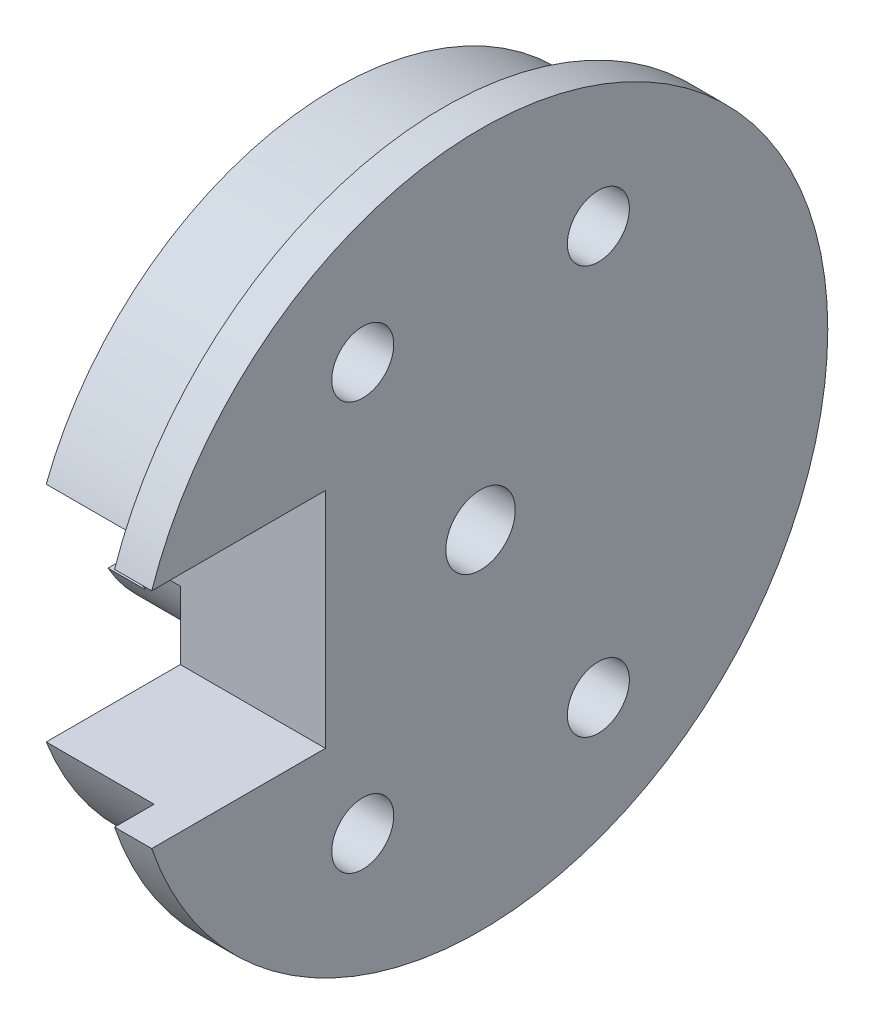
ISO-10303-21;
HEADER;
FILE_DESCRIPTION(('STEP AP214'),'2;1');
FILE_NAME('part.step','',(''),(''),'','','');
FILE_SCHEMA(('AUTOMOTIVE_DESIGN { 1 0 10303 214 1 1 1 1 }'));
ENDSEC;
DATA;
#1=APPLICATION_CONTEXT('core data for automotive mechanical design processes');
#2=APPLICATION_PROTOCOL_DEFINITION('international standard','automotive_design',2000,#1);
#3=PRODUCT_CONTEXT('',#1,'mechanical');
#4=PRODUCT('Part','Part','',(#3));
#5=PRODUCT_RELATED_PRODUCT_CATEGORY('part','',(#4));
#6=PRODUCT_DEFINITION_FORMATION('','',#4);
#7=PRODUCT_DEFINITION_CONTEXT('part definition',#1,'design');
#8=PRODUCT_DEFINITION('design','',#6,#7);
#9=PRODUCT_DEFINITION_SHAPE('','',#8);
#10=(LENGTH_UNIT() NAMED_UNIT(*) SI_UNIT(.MILLI.,.METRE.));
#11=(NAMED_UNIT(*) PLANE_ANGLE_UNIT() SI_UNIT($,.RADIAN.));
#12=(NAMED_UNIT(*) SI_UNIT($,.STERADIAN.) SOLID_ANGLE_UNIT());
#13=UNCERTAINTY_MEASURE_WITH_UNIT(LENGTH_MEASURE(1.E-05),#10,'distance_accuracy_value','');
#14=(GEOMETRIC_REPRESENTATION_CONTEXT(3) GLOBAL_UNCERTAINTY_ASSIGNED_CONTEXT((#13)) GLOBAL_UNIT_ASSIGNED_CONTEXT((#10,
#11,#12)) REPRESENTATION_CONTEXT('',''));
#15=CARTESIAN_POINT('',(0.,0.,0.));
#16=DIRECTION('',(0.,0.,1.));
#17=DIRECTION('',(1.,0.,0.));
#18=AXIS2_PLACEMENT_3D('',#15,#16,#17);
#19=CARTESIAN_POINT('',(-22.0709534368071,0.,0.));
#20=DIRECTION('',(-1.,0.,0.));
#21=DIRECTION('',(0.,0.,1.));
#22=AXIS2_PLACEMENT_3D('',#19,#20,#21);
#23=CYLINDRICAL_SURFACE('',#22,6.5);
#24=DIRECTION('',(-1.,0.,0.));
#25=VECTOR('',#24,1.);
#26=CARTESIAN_POINT('',(-22.0709534368071,1.76040625137492,6.25707358356285));
#27=LINE('',#26,#25);
#28=CARTESIAN_POINT('',(8.15,1.76040625137492,6.25707358356285));
#29=VERTEX_POINT('',#28);
#30=CARTESIAN_POINT('',(6.15,1.76040625137492,6.25707358356285));
#31=VERTEX_POINT('',#30);
#32=EDGE_CURVE('E58',#29,#31,#27,.T.);
#33=ORIENTED_EDGE('',*,*,#32,.F.);
#34=CARTESIAN_POINT('',(8.15,0.,0.));
#35=DIRECTION('',(-1.,0.,0.));
#36=DIRECTION('',(0.,0.,1.));
#37=AXIS2_PLACEMENT_3D('',#34,#35,#36);
#38=CIRCLE('',#37,6.5);
#39=CARTESIAN_POINT('',(8.15,-1.76040625137492,6.25707358356285));
#40=VERTEX_POINT('',#39);
#41=EDGE_CURVE('E241',#29,#40,#38,.T.);
#42=ORIENTED_EDGE('',*,*,#41,.T.);
#43=DIRECTION('',(-1.,0.,0.));
#44=VECTOR('',#43,1.);
#45=CARTESIAN_POINT('',(-22.0709534368071,-1.76040625137492,6.25707358356285));
#46=LINE('',#45,#44);
#47=CARTESIAN_POINT('',(6.15,-1.76040625137492,6.25707358356285));
#48=VERTEX_POINT('',#47);
#49=EDGE_CURVE('E177',#48,#40,#46,.F.);
#50=ORIENTED_EDGE('',*,*,#49,.F.);
#51=CARTESIAN_POINT('',(6.15,0.,0.));
#52=DIRECTION('',(1.,0.,0.));
#53=DIRECTION('',(0.,0.,-1.));
#54=AXIS2_PLACEMENT_3D('',#51,#52,#53);
#55=CIRCLE('',#54,6.5);
#56=CARTESIAN_POINT('',(6.15,-3.175,5.67180526816639));
#57=VERTEX_POINT('',#56);
#58=EDGE_CURVE('E66',#48,#57,#55,.T.);
#59=ORIENTED_EDGE('',*,*,#58,.T.);
#60=DIRECTION('',(-1.,0.,0.));
#61=VECTOR('',#60,1.);
#62=CARTESIAN_POINT('',(-22.0709534368071,-3.175,5.67180526816639));
#63=LINE('',#62,#61);
#64=CARTESIAN_POINT('',(4.65,-3.175,5.67180526816639));
#65=VERTEX_POINT('',#64);
#66=EDGE_CURVE('E200',#65,#57,#63,.F.);
#67=ORIENTED_EDGE('',*,*,#66,.F.);
#68=CARTESIAN_POINT('',(4.65,0.,0.));
#69=DIRECTION('',(-1.,0.,0.));
#70=DIRECTION('',(0.,0.,1.));
#71=AXIS2_PLACEMENT_3D('',#68,#69,#70);
#72=CIRCLE('',#71,6.5);
#73=CARTESIAN_POINT('',(4.65,-3.175,-5.67180526816639));
#74=VERTEX_POINT('',#73);
#75=EDGE_CURVE('E249',#74,#65,#72,.T.);
#76=ORIENTED_EDGE('',*,*,#75,.F.);
#77=DIRECTION('',(-1.,0.,0.));
#78=VECTOR('',#77,1.);
#79=CARTESIAN_POINT('',(-22.0709534368071,-3.175,-5.67180526816639));
#80=LINE('',#79,#78);
#81=CARTESIAN_POINT('',(6.15,-3.175,-5.67180526816639));
#82=VERTEX_POINT('',#81);
#83=EDGE_CURVE('E194',#82,#74,#80,.T.);
#84=ORIENTED_EDGE('',*,*,#83,.F.);
#85=CARTESIAN_POINT('',(6.15,3.175,-5.67180526816639));
#86=VERTEX_POINT('',#85);
#87=EDGE_CURVE('E185',#82,#86,#55,.T.);
#88=ORIENTED_EDGE('',*,*,#87,.T.);
#89=DIRECTION('',(-1.,0.,0.));
#90=VECTOR('',#89,1.);
#91=CARTESIAN_POINT('',(-22.0709534368071,3.175,-5.67180526816639));
#92=LINE('',#91,#90);
#93=CARTESIAN_POINT('',(4.65,3.175,-5.67180526816639));
#94=VERTEX_POINT('',#93);
#95=EDGE_CURVE('E197',#94,#86,#92,.F.);
#96=ORIENTED_EDGE('',*,*,#95,.F.);
#97=CARTESIAN_POINT('',(4.65,3.175,5.67180526816639));
#98=VERTEX_POINT('',#97);
#99=EDGE_CURVE('E250',#98,#94,#72,.T.);
#100=ORIENTED_EDGE('',*,*,#99,.F.);
#101=DIRECTION('',(-1.,0.,0.));
#102=VECTOR('',#101,1.);
#103=CARTESIAN_POINT('',(-22.0709534368071,3.175,5.67180526816639));
#104=LINE('',#103,#102);
#105=CARTESIAN_POINT('',(6.15,3.175,5.67180526816639));
#106=VERTEX_POINT('',#105);
#107=EDGE_CURVE('E203',#106,#98,#104,.T.);
#108=ORIENTED_EDGE('',*,*,#107,.F.);
#109=EDGE_CURVE('E195',#106,#31,#55,.T.);
#110=ORIENTED_EDGE('',*,*,#109,.T.);
#111=EDGE_LOOP('',(#33,#42,#50,#59,#67,#76,#84,#88,#96,#100,#108,#110));
#112=FACE_BOUND('',#111,.T.);
#113=ADVANCED_FACE('F43',(#112),#23,.T.);
#114=CARTESIAN_POINT('',(12.5,12.5,0.));
#115=DIRECTION('',(1.,0.,0.));
#116=DIRECTION('',(0.,0.,-1.));
#117=AXIS2_PLACEMENT_3D('',#114,#115,#116);
#118=PLANE('',#117);
#119=DIRECTION('',(0.,0.,-1.));
#120=VECTOR('',#119,1.);
#121=CARTESIAN_POINT('',(12.5,4.5,0.));
#122=LINE('',#121,#120);
#123=CARTESIAN_POINT('',(12.5,4.5,13.2570735835629));
#124=VERTEX_POINT('',#123);
#125=CARTESIAN_POINT('',(12.5,4.5,11.6619037896906));
#126=VERTEX_POINT('',#125);
#127=EDGE_CURVE('E349',#124,#126,#122,.T.);
#128=ORIENTED_EDGE('',*,*,#127,.F.);
#129=CARTESIAN_POINT('',(12.5,0.,0.));
#130=DIRECTION('',(-1.,0.,0.));
#131=DIRECTION('',(0.,0.,1.));
#132=AXIS2_PLACEMENT_3D('',#129,#130,#131);
#133=CIRCLE('',#132,14.);
#134=CARTESIAN_POINT('',(12.5,-4.5,13.2570735835629));
#135=VERTEX_POINT('',#134);
#136=EDGE_CURVE('E176',#124,#135,#133,.T.);
#137=ORIENTED_EDGE('',*,*,#136,.T.);
#138=DIRECTION('',(0.,0.,1.));
#139=VECTOR('',#138,1.);
#140=CARTESIAN_POINT('',(12.5,-4.5,0.));
#141=LINE('',#140,#139);
#142=CARTESIAN_POINT('',(12.5,-4.5,11.6619037896906));
#143=VERTEX_POINT('',#142);
#144=EDGE_CURVE('E223',#143,#135,#141,.T.);
#145=ORIENTED_EDGE('',*,*,#144,.F.);
#146=CARTESIAN_POINT('',(12.5,0.,0.));
#147=DIRECTION('',(-1.,0.,0.));
#148=DIRECTION('',(0.,0.,1.));
#149=AXIS2_PLACEMENT_3D('',#146,#147,#148);
#150=CIRCLE('',#149,12.5);
#151=EDGE_CURVE('E233',#126,#143,#150,.T.);
#152=ORIENTED_EDGE('',*,*,#151,.F.);
#153=EDGE_LOOP('',(#128,#137,#145,#152));
#154=FACE_BOUND('',#153,.T.);
#155=ADVANCED_FACE('F45',(#154),#118,.F.);
#156=CARTESIAN_POINT('',(-22.0709534368071,0.,0.));
#157=DIRECTION('',(-1.,0.,0.));
#158=DIRECTION('',(0.,0.,1.));
#159=AXIS2_PLACEMENT_3D('',#156,#157,#158);
#160=CYLINDRICAL_SURFACE('',#159,14.);
#161=DIRECTION('',(1.,0.,0.));
#162=VECTOR('',#161,1.);
#163=CARTESIAN_POINT('',(-14.,4.5,13.2570735835629));
#164=LINE('',#163,#162);
#165=CARTESIAN_POINT('',(14.,4.5,13.2570735835629));
#166=VERTEX_POINT('',#165);
#167=EDGE_CURVE('E159',#124,#166,#164,.T.);
#168=ORIENTED_EDGE('',*,*,#167,.T.);
#169=CARTESIAN_POINT('',(14.,0.,0.));
#170=DIRECTION('',(-1.,0.,0.));
#171=DIRECTION('',(0.,0.,1.));
#172=AXIS2_PLACEMENT_3D('',#169,#170,#171);
#173=CIRCLE('',#172,14.);
#174=CARTESIAN_POINT('',(14.,-4.5,13.2570735835629));
#175=VERTEX_POINT('',#174);
#176=EDGE_CURVE('E174',#166,#175,#173,.T.);
#177=ORIENTED_EDGE('',*,*,#176,.T.);
#178=DIRECTION('',(1.,0.,0.));
#179=VECTOR('',#178,1.);
#180=CARTESIAN_POINT('',(-14.,-4.5,13.2570735835629));
#181=LINE('',#180,#179);
#182=EDGE_CURVE('E361',#135,#175,#181,.T.);
#183=ORIENTED_EDGE('',*,*,#182,.F.);
#184=ORIENTED_EDGE('',*,*,#136,.F.);
#185=EDGE_LOOP('',(#168,#177,#183,#184));
#186=FACE_BOUND('',#185,.T.);
#187=ADVANCED_FACE('F172',(#186),#160,.T.);
#188=CARTESIAN_POINT('',(14.,14.,0.));
#189=DIRECTION('',(-1.,0.,0.));
#190=DIRECTION('',(0.,0.,1.));
#191=AXIS2_PLACEMENT_3D('',#188,#189,#190);
#192=PLANE('',#191);
#193=CARTESIAN_POINT('',(14.,0.,0.));
#194=DIRECTION('',(-1.,0.,0.));
#195=DIRECTION('',(0.,0.,1.));
#196=AXIS2_PLACEMENT_3D('',#193,#194,#195);
#197=CIRCLE('',#196,1.4);
#198=CARTESIAN_POINT('',(14.,0.,1.4));
#199=VERTEX_POINT('',#198);
#200=EDGE_CURVE('E183',#199,#199,#197,.T.);
#201=ORIENTED_EDGE('',*,*,#200,.T.);
#202=EDGE_LOOP('',(#201));
#203=FACE_BOUND('',#202,.T.);
#204=CARTESIAN_POINT('',(14.,8.22724133595217,4.75));
#205=DIRECTION('',(-1.,0.,0.));
#206=DIRECTION('',(0.,0.,1.));
#207=AXIS2_PLACEMENT_3D('',#204,#205,#206);
#208=CIRCLE('',#207,1.24999999999999);
#209=CARTESIAN_POINT('',(14.,8.22724133595217,5.99999999999999));
#210=VERTEX_POINT('',#209);
#211=EDGE_CURVE('E209',#210,#210,#208,.T.);
#212=ORIENTED_EDGE('',*,*,#211,.T.);
#213=EDGE_LOOP('',(#212));
#214=FACE_BOUND('',#213,.T.);
#215=CARTESIAN_POINT('',(14.,8.22724133595217,-4.75));
#216=DIRECTION('',(-1.,0.,0.));
#217=DIRECTION('',(0.,0.,1.));
#218=AXIS2_PLACEMENT_3D('',#215,#216,#217);
#219=CIRCLE('',#218,1.24999999999999);
#220=CARTESIAN_POINT('',(14.,8.22724133595217,-3.50000000000001));
#221=VERTEX_POINT('',#220);
#222=EDGE_CURVE('E210',#221,#221,#219,.T.);
#223=ORIENTED_EDGE('',*,*,#222,.T.);
#224=EDGE_LOOP('',(#223));
#225=FACE_BOUND('',#224,.T.);
#226=CARTESIAN_POINT('',(14.,-8.22724133595217,-4.75));
#227=DIRECTION('',(-1.,0.,0.));
#228=DIRECTION('',(0.,0.,1.));
#229=AXIS2_PLACEMENT_3D('',#226,#227,#228);
#230=CIRCLE('',#229,1.24999999999999);
#231=CARTESIAN_POINT('',(14.,-8.22724133595217,-3.5));
#232=VERTEX_POINT('',#231);
#233=EDGE_CURVE('E214',#232,#232,#230,.T.);
#234=ORIENTED_EDGE('',*,*,#233,.T.);
#235=EDGE_LOOP('',(#234));
#236=FACE_BOUND('',#235,.T.);
#237=CARTESIAN_POINT('',(14.,-8.22724133595217,4.75));
#238=DIRECTION('',(-1.,0.,0.));
#239=DIRECTION('',(0.,0.,1.));
#240=AXIS2_PLACEMENT_3D('',#237,#238,#239);
#241=CIRCLE('',#240,1.24999999999999);
#242=CARTESIAN_POINT('',(14.,-8.22724133595217,5.99999999999999));
#243=VERTEX_POINT('',#242);
#244=EDGE_CURVE('E218',#243,#243,#241,.T.);
#245=ORIENTED_EDGE('',*,*,#244,.T.);
#246=EDGE_LOOP('',(#245));
#247=FACE_BOUND('',#246,.T.);
#248=DIRECTION('',(0.,0.,-1.));
#249=VECTOR('',#248,1.);
#250=CARTESIAN_POINT('',(14.,4.5,6.25707358356285));
#251=LINE('',#250,#249);
#252=CARTESIAN_POINT('',(14.,4.5,6.25707358356285));
#253=VERTEX_POINT('',#252);
#254=EDGE_CURVE('E156',#166,#253,#251,.T.);
#255=ORIENTED_EDGE('',*,*,#254,.T.);
#256=DIRECTION('',(0.,-1.,0.));
#257=VECTOR('',#256,1.);
#258=CARTESIAN_POINT('',(14.,-4.5,6.25707358356285));
#259=LINE('',#258,#257);
#260=CARTESIAN_POINT('',(14.,-4.5,6.25707358356285));
#261=VERTEX_POINT('',#260);
#262=EDGE_CURVE('E167',#253,#261,#259,.T.);
#263=ORIENTED_EDGE('',*,*,#262,.T.);
#264=DIRECTION('',(0.,0.,1.));
#265=VECTOR('',#264,1.);
#266=CARTESIAN_POINT('',(14.,-4.5,6.25707358356285));
#267=LINE('',#266,#265);
#268=EDGE_CURVE('E182',#261,#175,#267,.T.);
#269=ORIENTED_EDGE('',*,*,#268,.T.);
#270=ORIENTED_EDGE('',*,*,#176,.F.);
#271=EDGE_LOOP('',(#255,#263,#269,#270));
#272=FACE_BOUND('',#271,.T.);
#273=ADVANCED_FACE('F180',(#203,#214,#225,#236,#247,#272),#192,.F.);
#274=CARTESIAN_POINT('',(8.15,6.5,0.));
#275=DIRECTION('',(1.,0.,0.));
#276=DIRECTION('',(0.,0.,-1.));
#277=AXIS2_PLACEMENT_3D('',#274,#275,#276);
#278=PLANE('',#277);
#279=CARTESIAN_POINT('',(8.15,8.22724133595217,4.75));
#280=DIRECTION('',(1.,0.,0.));
#281=DIRECTION('',(0.,0.,-1.));
#282=AXIS2_PLACEMENT_3D('',#279,#280,#281);
#283=CIRCLE('',#282,1.24999999999999);
#284=CARTESIAN_POINT('',(8.15,8.22724133595217,3.50000000000001));
#285=VERTEX_POINT('',#284);
#286=EDGE_CURVE('E335',#285,#285,#283,.T.);
#287=ORIENTED_EDGE('',*,*,#286,.T.);
#288=EDGE_LOOP('',(#287));
#289=FACE_BOUND('',#288,.T.);
#290=CARTESIAN_POINT('',(8.15,8.22724133595217,-4.75));
#291=DIRECTION('',(1.,0.,0.));
#292=DIRECTION('',(0.,0.,-1.));
#293=AXIS2_PLACEMENT_3D('',#290,#291,#292);
#294=CIRCLE('',#293,1.24999999999999);
#295=CARTESIAN_POINT('',(8.15,8.22724133595217,-6.));
#296=VERTEX_POINT('',#295);
#297=EDGE_CURVE('E206',#296,#296,#294,.T.);
#298=ORIENTED_EDGE('',*,*,#297,.T.);
#299=EDGE_LOOP('',(#298));
#300=FACE_BOUND('',#299,.T.);
#301=CARTESIAN_POINT('',(8.15,-8.22724133595217,-4.75));
#302=DIRECTION('',(1.,0.,0.));
#303=DIRECTION('',(0.,0.,-1.));
#304=AXIS2_PLACEMENT_3D('',#301,#302,#303);
#305=CIRCLE('',#304,1.25);
#306=CARTESIAN_POINT('',(8.15,-8.22724133595217,-5.99999999999999));
#307=VERTEX_POINT('',#306);
#308=EDGE_CURVE('E211',#307,#307,#305,.T.);
#309=ORIENTED_EDGE('',*,*,#308,.T.);
#310=EDGE_LOOP('',(#309));
#311=FACE_BOUND('',#310,.T.);
#312=CARTESIAN_POINT('',(8.15,-8.22724133595217,4.75));
#313=DIRECTION('',(1.,0.,0.));
#314=DIRECTION('',(0.,0.,-1.));
#315=AXIS2_PLACEMENT_3D('',#312,#313,#314);
#316=CIRCLE('',#315,1.25);
#317=CARTESIAN_POINT('',(8.15,-8.22724133595217,3.50000000000001));
#318=VERTEX_POINT('',#317);
#319=EDGE_CURVE('E215',#318,#318,#316,.T.);
#320=ORIENTED_EDGE('',*,*,#319,.T.);
#321=EDGE_LOOP('',(#320));
#322=FACE_BOUND('',#321,.T.);
#323=DIRECTION('',(0.,0.,-1.));
#324=VECTOR('',#323,1.);
#325=CARTESIAN_POINT('',(8.15,4.5,0.));
#326=LINE('',#325,#324);
#327=CARTESIAN_POINT('',(8.15,4.5,11.6619037896906));
#328=VERTEX_POINT('',#327);
#329=CARTESIAN_POINT('',(8.15,4.5,6.25707358356285));
#330=VERTEX_POINT('',#329);
#331=EDGE_CURVE('E234',#328,#330,#326,.T.);
#332=ORIENTED_EDGE('',*,*,#331,.F.);
#333=CARTESIAN_POINT('',(8.15,0.,0.));
#334=DIRECTION('',(-1.,0.,0.));
#335=DIRECTION('',(0.,0.,1.));
#336=AXIS2_PLACEMENT_3D('',#333,#334,#335);
#337=CIRCLE('',#336,12.5);
#338=CARTESIAN_POINT('',(8.15,-4.5,11.6619037896906));
#339=VERTEX_POINT('',#338);
#340=EDGE_CURVE('E238',#328,#339,#337,.T.);
#341=ORIENTED_EDGE('',*,*,#340,.T.);
#342=DIRECTION('',(0.,0.,1.));
#343=VECTOR('',#342,1.);
#344=CARTESIAN_POINT('',(8.15,-4.5,0.));
#345=LINE('',#344,#343);
#346=CARTESIAN_POINT('',(8.15,-4.5,6.25707358356285));
#347=VERTEX_POINT('',#346);
#348=EDGE_CURVE('E226',#347,#339,#345,.T.);
#349=ORIENTED_EDGE('',*,*,#348,.F.);
#350=DIRECTION('',(0.,-1.,0.));
#351=VECTOR('',#350,1.);
#352=CARTESIAN_POINT('',(8.15,6.5,6.25707358356285));
#353=LINE('',#352,#351);
#354=EDGE_CURVE('E354',#40,#347,#353,.T.);
#355=ORIENTED_EDGE('',*,*,#354,.F.);
#356=ORIENTED_EDGE('',*,*,#41,.F.);
#357=EDGE_CURVE('E353',#330,#29,#353,.T.);
#358=ORIENTED_EDGE('',*,*,#357,.F.);
#359=EDGE_LOOP('',(#332,#341,#349,#355,#356,#358));
#360=FACE_BOUND('',#359,.T.);
#361=ADVANCED_FACE('F369',(#289,#300,#311,#322,#360),#278,.F.);
#362=CARTESIAN_POINT('',(-22.0709534368071,0.,0.));
#363=DIRECTION('',(-1.,0.,0.));
#364=DIRECTION('',(0.,0.,1.));
#365=AXIS2_PLACEMENT_3D('',#362,#363,#364);
#366=CYLINDRICAL_SURFACE('',#365,12.5);
#367=DIRECTION('',(-1.,0.,0.));
#368=VECTOR('',#367,1.);
#369=CARTESIAN_POINT('',(-22.0709534368071,4.5,11.6619037896906));
#370=LINE('',#369,#368);
#371=EDGE_CURVE('E12',#126,#328,#370,.T.);
#372=ORIENTED_EDGE('',*,*,#371,.F.);
#373=ORIENTED_EDGE('',*,*,#151,.T.);
#374=DIRECTION('',(-1.,0.,0.));
#375=VECTOR('',#374,1.);
#376=CARTESIAN_POINT('',(-22.0709534368071,-4.5,11.6619037896906));
#377=LINE('',#376,#375);
#378=EDGE_CURVE('E51',#339,#143,#377,.F.);
#379=ORIENTED_EDGE('',*,*,#378,.F.);
#380=ORIENTED_EDGE('',*,*,#340,.F.);
#381=EDGE_LOOP('',(#372,#373,#379,#380));
#382=FACE_BOUND('',#381,.T.);
#383=ADVANCED_FACE('F237',(#382),#366,.T.);
#384=CARTESIAN_POINT('',(6.15,4.,0.));
#385=DIRECTION('',(1.,0.,0.));
#386=DIRECTION('',(0.,0.,-1.));
#387=AXIS2_PLACEMENT_3D('',#384,#385,#386);
#388=PLANE('',#387);
#389=DIRECTION('',(0.,-1.,0.));
#390=VECTOR('',#389,1.);
#391=CARTESIAN_POINT('',(6.15,4.,6.25707358356285));
#392=LINE('',#391,#390);
#393=EDGE_CURVE('E205',#31,#48,#392,.T.);
#394=ORIENTED_EDGE('',*,*,#393,.F.);
#395=ORIENTED_EDGE('',*,*,#109,.F.);
#396=DIRECTION('',(0.,0.,1.));
#397=VECTOR('',#396,1.);
#398=CARTESIAN_POINT('',(6.15,3.175,13.6352255206872));
#399=LINE('',#398,#397);
#400=CARTESIAN_POINT('',(6.15,3.175,2.43297657202037));
#401=VERTEX_POINT('',#400);
#402=EDGE_CURVE('E300',#401,#106,#399,.T.);
#403=ORIENTED_EDGE('',*,*,#402,.F.);
#404=CARTESIAN_POINT('',(6.15,0.,0.));
#405=DIRECTION('',(1.,0.,0.));
#406=DIRECTION('',(0.,0.,-1.));
#407=AXIS2_PLACEMENT_3D('',#404,#405,#406);
#408=CIRCLE('',#407,4.);
#409=CARTESIAN_POINT('',(6.15,-3.175,2.43297657202037));
#410=VERTEX_POINT('',#409);
#411=EDGE_CURVE('E282',#410,#401,#408,.F.);
#412=ORIENTED_EDGE('',*,*,#411,.F.);
#413=DIRECTION('',(0.,0.,-1.));
#414=VECTOR('',#413,1.);
#415=CARTESIAN_POINT('',(6.15,-3.175,13.6352255206872));
#416=LINE('',#415,#414);
#417=EDGE_CURVE('E333',#57,#410,#416,.T.);
#418=ORIENTED_EDGE('',*,*,#417,.F.);
#419=ORIENTED_EDGE('',*,*,#58,.F.);
#420=EDGE_LOOP('',(#394,#395,#403,#412,#418,#419));
#421=FACE_BOUND('',#420,.T.);
#422=ADVANCED_FACE('F275',(#421),#388,.F.);
#423=CARTESIAN_POINT('',(-22.0709534368071,0.,0.));
#424=DIRECTION('',(-1.,0.,0.));
#425=DIRECTION('',(0.,0.,1.));
#426=AXIS2_PLACEMENT_3D('',#423,#424,#425);
#427=CYLINDRICAL_SURFACE('',#426,4.);
#428=CARTESIAN_POINT('',(7.5,0.,0.));
#429=DIRECTION('',(-1.,0.,0.));
#430=DIRECTION('',(0.,0.,1.));
#431=AXIS2_PLACEMENT_3D('',#428,#429,#430);
#432=CIRCLE('',#431,4.);
#433=CARTESIAN_POINT('',(7.5,0.,4.));
#434=VERTEX_POINT('',#433);
#435=EDGE_CURVE('E257',#434,#434,#432,.T.);
#436=ORIENTED_EDGE('',*,*,#435,.F.);
#437=EDGE_LOOP('',(#436));
#438=FACE_BOUND('',#437,.T.);
#439=DIRECTION('',(-1.,0.,0.));
#440=VECTOR('',#439,1.);
#441=CARTESIAN_POINT('',(-22.0709534368071,3.175,2.43297657202037));
#442=LINE('',#441,#440);
#443=CARTESIAN_POINT('',(4.65,3.175,2.43297657202037));
#444=VERTEX_POINT('',#443);
#445=EDGE_CURVE('E239',#444,#401,#442,.F.);
#446=ORIENTED_EDGE('',*,*,#445,.F.);
#447=CARTESIAN_POINT('',(4.65,0.,0.));
#448=DIRECTION('',(-1.,0.,0.));
#449=DIRECTION('',(0.,0.,1.));
#450=AXIS2_PLACEMENT_3D('',#447,#448,#449);
#451=CIRCLE('',#450,4.);
#452=CARTESIAN_POINT('',(4.65,3.175,-2.43297657202037));
#453=VERTEX_POINT('',#452);
#454=EDGE_CURVE('E254',#444,#453,#451,.T.);
#455=ORIENTED_EDGE('',*,*,#454,.T.);
#456=DIRECTION('',(-1.,0.,0.));
#457=VECTOR('',#456,1.);
#458=CARTESIAN_POINT('',(-22.0709534368071,3.175,-2.43297657202037));
#459=LINE('',#458,#457);
#460=CARTESIAN_POINT('',(6.15,3.175,-2.43297657202037));
#461=VERTEX_POINT('',#460);
#462=EDGE_CURVE('E293',#461,#453,#459,.T.);
#463=ORIENTED_EDGE('',*,*,#462,.F.);
#464=CARTESIAN_POINT('',(6.15,-3.175,-2.43297657202037));
#465=VERTEX_POINT('',#464);
#466=EDGE_CURVE('E307',#461,#465,#408,.F.);
#467=ORIENTED_EDGE('',*,*,#466,.T.);
#468=DIRECTION('',(-1.,0.,0.));
#469=VECTOR('',#468,1.);
#470=CARTESIAN_POINT('',(-22.0709534368071,-3.175,-2.43297657202037));
#471=LINE('',#470,#469);
#472=CARTESIAN_POINT('',(4.65,-3.175,-2.43297657202037));
#473=VERTEX_POINT('',#472);
#474=EDGE_CURVE('E294',#473,#465,#471,.F.);
#475=ORIENTED_EDGE('',*,*,#474,.F.);
#476=CARTESIAN_POINT('',(4.65,-3.175,2.43297657202037));
#477=VERTEX_POINT('',#476);
#478=EDGE_CURVE('E253',#473,#477,#451,.T.);
#479=ORIENTED_EDGE('',*,*,#478,.T.);
#480=DIRECTION('',(-1.,0.,0.));
#481=VECTOR('',#480,1.);
#482=CARTESIAN_POINT('',(-22.0709534368071,-3.175,2.43297657202037));
#483=LINE('',#482,#481);
#484=EDGE_CURVE('E320',#410,#477,#483,.T.);
#485=ORIENTED_EDGE('',*,*,#484,.F.);
#486=ORIENTED_EDGE('',*,*,#411,.T.);
#487=EDGE_LOOP('',(#446,#455,#463,#467,#475,#479,#485,#486));
#488=FACE_BOUND('',#487,.T.);
#489=ADVANCED_FACE('F271',(#438,#488),#427,.F.);
#490=CARTESIAN_POINT('',(4.65,4.,0.));
#491=DIRECTION('',(1.,0.,0.));
#492=DIRECTION('',(0.,0.,-1.));
#493=AXIS2_PLACEMENT_3D('',#490,#491,#492);
#494=PLANE('',#493);
#495=DIRECTION('',(0.,0.,-1.));
#496=VECTOR('',#495,1.);
#497=CARTESIAN_POINT('',(4.65,3.175,0.));
#498=LINE('',#497,#496);
#499=EDGE_CURVE('E243',#98,#444,#498,.T.);
#500=ORIENTED_EDGE('',*,*,#499,.F.);
#501=ORIENTED_EDGE('',*,*,#99,.T.);
#502=EDGE_CURVE('E290',#453,#94,#498,.T.);
#503=ORIENTED_EDGE('',*,*,#502,.F.);
#504=ORIENTED_EDGE('',*,*,#454,.F.);
#505=EDGE_LOOP('',(#500,#501,#503,#504));
#506=FACE_BOUND('',#505,.T.);
#507=ADVANCED_FACE('F274',(#506),#494,.F.);
#508=DIRECTION('',(0.,0.,1.));
#509=VECTOR('',#508,1.);
#510=CARTESIAN_POINT('',(4.65,-3.175,0.));
#511=LINE('',#510,#509);
#512=EDGE_CURVE('E296',#74,#473,#511,.T.);
#513=ORIENTED_EDGE('',*,*,#512,.F.);
#514=ORIENTED_EDGE('',*,*,#75,.T.);
#515=EDGE_CURVE('E315',#477,#65,#511,.T.);
#516=ORIENTED_EDGE('',*,*,#515,.F.);
#517=ORIENTED_EDGE('',*,*,#478,.F.);
#518=EDGE_LOOP('',(#513,#514,#516,#517));
#519=FACE_BOUND('',#518,.T.);
#520=ADVANCED_FACE('F331',(#519),#494,.F.);
#521=CARTESIAN_POINT('',(-22.0709534368071,0.,0.));
#522=DIRECTION('',(-1.,0.,0.));
#523=DIRECTION('',(0.,0.,1.));
#524=AXIS2_PLACEMENT_3D('',#521,#522,#523);
#525=CYLINDRICAL_SURFACE('',#524,1.4);
#526=ORIENTED_EDGE('',*,*,#200,.F.);
#527=EDGE_LOOP('',(#526));
#528=FACE_BOUND('',#527,.T.);
#529=CARTESIAN_POINT('',(7.49999999999999,0.,0.));
#530=DIRECTION('',(-1.,0.,0.));
#531=DIRECTION('',(0.,0.,1.));
#532=AXIS2_PLACEMENT_3D('',#529,#530,#531);
#533=CIRCLE('',#532,1.4);
#534=CARTESIAN_POINT('',(7.49999999999999,0.,1.4));
#535=VERTEX_POINT('',#534);
#536=EDGE_CURVE('E188',#535,#535,#533,.T.);
#537=ORIENTED_EDGE('',*,*,#536,.T.);
#538=EDGE_LOOP('',(#537));
#539=FACE_BOUND('',#538,.T.);
#540=ADVANCED_FACE('F262',(#528,#539),#525,.F.);
#541=CARTESIAN_POINT('',(7.5,1.4,0.));
#542=DIRECTION('',(1.,0.,0.));
#543=DIRECTION('',(0.,0.,-1.));
#544=AXIS2_PLACEMENT_3D('',#541,#542,#543);
#545=PLANE('',#544);
#546=ORIENTED_EDGE('',*,*,#536,.F.);
#547=EDGE_LOOP('',(#546));
#548=FACE_BOUND('',#547,.T.);
#549=ORIENTED_EDGE('',*,*,#435,.T.);
#550=EDGE_LOOP('',(#549));
#551=FACE_BOUND('',#550,.T.);
#552=ADVANCED_FACE('F264',(#548,#551),#545,.F.);
#553=EDGE_CURVE('E305',#86,#461,#399,.T.);
#554=ORIENTED_EDGE('',*,*,#553,.F.);
#555=ORIENTED_EDGE('',*,*,#87,.F.);
#556=EDGE_CURVE('E318',#465,#82,#416,.T.);
#557=ORIENTED_EDGE('',*,*,#556,.F.);
#558=ORIENTED_EDGE('',*,*,#466,.F.);
#559=EDGE_LOOP('',(#554,#555,#557,#558));
#560=FACE_BOUND('',#559,.T.);
#561=ADVANCED_FACE('F267',(#560),#388,.F.);
#562=CARTESIAN_POINT('',(36.3610170492095,-3.175,13.6352255206872));
#563=DIRECTION('',(0.,1.,0.));
#564=DIRECTION('',(0.,0.,1.));
#565=AXIS2_PLACEMENT_3D('',#562,#563,#564);
#566=PLANE('',#565);
#567=ORIENTED_EDGE('',*,*,#474,.T.);
#568=ORIENTED_EDGE('',*,*,#556,.T.);
#569=ORIENTED_EDGE('',*,*,#83,.T.);
#570=ORIENTED_EDGE('',*,*,#512,.T.);
#571=EDGE_LOOP('',(#567,#568,#569,#570));
#572=FACE_BOUND('',#571,.T.);
#573=ADVANCED_FACE('F326',(#572),#566,.T.);
#574=CARTESIAN_POINT('',(36.3610170492095,3.175,13.6352255206872));
#575=DIRECTION('',(0.,-1.,0.));
#576=DIRECTION('',(0.,0.,-1.));
#577=AXIS2_PLACEMENT_3D('',#574,#575,#576);
#578=PLANE('',#577);
#579=ORIENTED_EDGE('',*,*,#462,.T.);
#580=ORIENTED_EDGE('',*,*,#502,.T.);
#581=ORIENTED_EDGE('',*,*,#95,.T.);
#582=ORIENTED_EDGE('',*,*,#553,.T.);
#583=EDGE_LOOP('',(#579,#580,#581,#582));
#584=FACE_BOUND('',#583,.T.);
#585=ADVANCED_FACE('F304',(#584),#578,.T.);
#586=ORIENTED_EDGE('',*,*,#445,.T.);
#587=ORIENTED_EDGE('',*,*,#402,.T.);
#588=ORIENTED_EDGE('',*,*,#107,.T.);
#589=ORIENTED_EDGE('',*,*,#499,.T.);
#590=EDGE_LOOP('',(#586,#587,#588,#589));
#591=FACE_BOUND('',#590,.T.);
#592=ADVANCED_FACE('F298',(#591),#578,.T.);
#593=ORIENTED_EDGE('',*,*,#484,.T.);
#594=ORIENTED_EDGE('',*,*,#515,.T.);
#595=ORIENTED_EDGE('',*,*,#66,.T.);
#596=ORIENTED_EDGE('',*,*,#417,.T.);
#597=EDGE_LOOP('',(#593,#594,#595,#596));
#598=FACE_BOUND('',#597,.T.);
#599=ADVANCED_FACE('F332',(#598),#566,.T.);
#600=CARTESIAN_POINT('',(-14.,8.22724133595217,4.75));
#601=DIRECTION('',(-1.,0.,0.));
#602=DIRECTION('',(0.,0.,1.));
#603=AXIS2_PLACEMENT_3D('',#600,#601,#602);
#604=CYLINDRICAL_SURFACE('',#603,1.24999999999999);
#605=ORIENTED_EDGE('',*,*,#211,.F.);
#606=EDGE_LOOP('',(#605));
#607=FACE_BOUND('',#606,.T.);
#608=ORIENTED_EDGE('',*,*,#286,.F.);
#609=EDGE_LOOP('',(#608));
#610=FACE_BOUND('',#609,.T.);
#611=ADVANCED_FACE('F495',(#607,#610),#604,.F.);
#612=CARTESIAN_POINT('',(-14.,8.22724133595217,-4.75));
#613=DIRECTION('',(-1.,0.,0.));
#614=DIRECTION('',(0.,0.,1.));
#615=AXIS2_PLACEMENT_3D('',#612,#613,#614);
#616=CYLINDRICAL_SURFACE('',#615,1.24999999999999);
#617=ORIENTED_EDGE('',*,*,#222,.F.);
#618=EDGE_LOOP('',(#617));
#619=FACE_BOUND('',#618,.T.);
#620=ORIENTED_EDGE('',*,*,#297,.F.);
#621=EDGE_LOOP('',(#620));
#622=FACE_BOUND('',#621,.T.);
#623=ADVANCED_FACE('F504',(#619,#622),#616,.F.);
#624=CARTESIAN_POINT('',(-14.,-8.22724133595217,-4.75));
#625=DIRECTION('',(-1.,0.,0.));
#626=DIRECTION('',(0.,0.,1.));
#627=AXIS2_PLACEMENT_3D('',#624,#625,#626);
#628=CYLINDRICAL_SURFACE('',#627,1.25);
#629=ORIENTED_EDGE('',*,*,#233,.F.);
#630=EDGE_LOOP('',(#629));
#631=FACE_BOUND('',#630,.T.);
#632=ORIENTED_EDGE('',*,*,#308,.F.);
#633=EDGE_LOOP('',(#632));
#634=FACE_BOUND('',#633,.T.);
#635=ADVANCED_FACE('F514',(#631,#634),#628,.F.);
#636=CARTESIAN_POINT('',(-14.,-8.22724133595217,4.75));
#637=DIRECTION('',(-1.,0.,0.));
#638=DIRECTION('',(0.,0.,1.));
#639=AXIS2_PLACEMENT_3D('',#636,#637,#638);
#640=CYLINDRICAL_SURFACE('',#639,1.25);
#641=ORIENTED_EDGE('',*,*,#244,.F.);
#642=EDGE_LOOP('',(#641));
#643=FACE_BOUND('',#642,.T.);
#644=ORIENTED_EDGE('',*,*,#319,.F.);
#645=EDGE_LOOP('',(#644));
#646=FACE_BOUND('',#645,.T.);
#647=ADVANCED_FACE('F524',(#643,#646),#640,.F.);
#648=CARTESIAN_POINT('',(-14.,4.5,6.25707358356285));
#649=DIRECTION('',(0.,-1.,0.));
#650=DIRECTION('',(0.,0.,-1.));
#651=AXIS2_PLACEMENT_3D('',#648,#649,#650);
#652=PLANE('',#651);
#653=ORIENTED_EDGE('',*,*,#127,.T.);
#654=ORIENTED_EDGE('',*,*,#371,.T.);
#655=ORIENTED_EDGE('',*,*,#331,.T.);
#656=DIRECTION('',(1.,0.,0.));
#657=VECTOR('',#656,1.);
#658=CARTESIAN_POINT('',(-14.,4.5,6.25707358356285));
#659=LINE('',#658,#657);
#660=EDGE_CURVE('E162',#330,#253,#659,.T.);
#661=ORIENTED_EDGE('',*,*,#660,.T.);
#662=ORIENTED_EDGE('',*,*,#254,.F.);
#663=ORIENTED_EDGE('',*,*,#167,.F.);
#664=EDGE_LOOP('',(#653,#654,#655,#661,#662,#663));
#665=FACE_BOUND('',#664,.T.);
#666=ADVANCED_FACE('F158',(#665),#652,.T.);
#667=CARTESIAN_POINT('',(-14.,-4.5,6.25707358356285));
#668=DIRECTION('',(0.,1.,0.));
#669=DIRECTION('',(0.,0.,1.));
#670=AXIS2_PLACEMENT_3D('',#667,#668,#669);
#671=PLANE('',#670);
#672=ORIENTED_EDGE('',*,*,#144,.T.);
#673=ORIENTED_EDGE('',*,*,#182,.T.);
#674=ORIENTED_EDGE('',*,*,#268,.F.);
#675=DIRECTION('',(1.,0.,0.));
#676=VECTOR('',#675,1.);
#677=CARTESIAN_POINT('',(-14.,-4.5,6.25707358356285));
#678=LINE('',#677,#676);
#679=EDGE_CURVE('E359',#347,#261,#678,.T.);
#680=ORIENTED_EDGE('',*,*,#679,.F.);
#681=ORIENTED_EDGE('',*,*,#348,.T.);
#682=ORIENTED_EDGE('',*,*,#378,.T.);
#683=EDGE_LOOP('',(#672,#673,#674,#680,#681,#682));
#684=FACE_BOUND('',#683,.T.);
#685=ADVANCED_FACE('F222',(#684),#671,.T.);
#686=CARTESIAN_POINT('',(-14.,-4.5,6.25707358356285));
#687=DIRECTION('',(0.,0.,1.));
#688=DIRECTION('',(1.,0.,0.));
#689=AXIS2_PLACEMENT_3D('',#686,#687,#688);
#690=PLANE('',#689);
#691=ORIENTED_EDGE('',*,*,#357,.T.);
#692=ORIENTED_EDGE('',*,*,#32,.T.);
#693=ORIENTED_EDGE('',*,*,#393,.T.);
#694=ORIENTED_EDGE('',*,*,#49,.T.);
#695=ORIENTED_EDGE('',*,*,#354,.T.);
#696=ORIENTED_EDGE('',*,*,#679,.T.);
#697=ORIENTED_EDGE('',*,*,#262,.F.);
#698=ORIENTED_EDGE('',*,*,#660,.F.);
#699=EDGE_LOOP('',(#691,#692,#693,#694,#695,#696,#697,#698));
#700=FACE_BOUND('',#699,.T.);
#701=ADVANCED_FACE('F364',(#700),#690,.T.);
#702=CLOSED_SHELL('',(#113,#155,#187,#273,#361,#383,#422,#489,#507,#520,#540,#552,#561,#573,
#585,#592,#599,#611,#623,#635,#647,#666,#685,#701));
#703=MANIFOLD_SOLID_BREP('B2',#702);
#704=ADVANCED_BREP_SHAPE_REPRESENTATION('',(#18,#703),#14);
#705=SHAPE_DEFINITION_REPRESENTATION(#9,#704);
ENDSEC;
END-ISO-10303-21;
